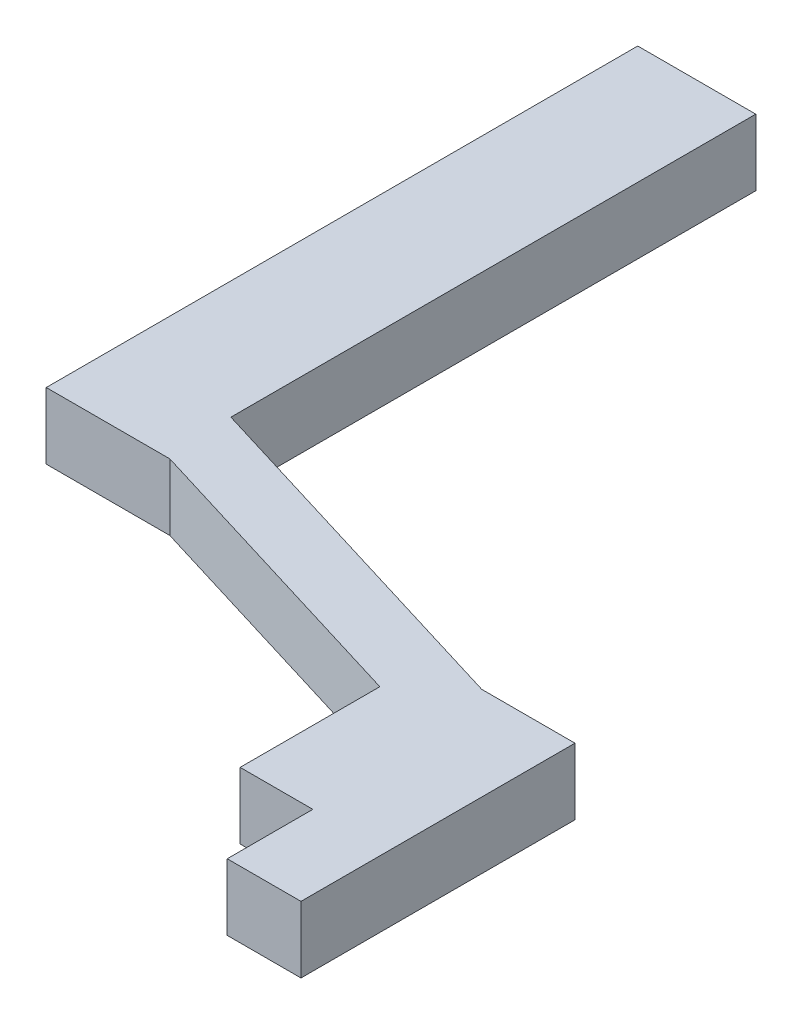
ISO-10303-21;
HEADER;
FILE_DESCRIPTION(('STEP AP214'),'2;1');
FILE_NAME('part.step','',(''),(''),'','','');
FILE_SCHEMA(('AUTOMOTIVE_DESIGN { 1 0 10303 214 1 1 1 1 }'));
ENDSEC;
DATA;
#1=APPLICATION_CONTEXT('core data for automotive mechanical design processes');
#2=APPLICATION_PROTOCOL_DEFINITION('international standard','automotive_design',2000,#1);
#3=PRODUCT_CONTEXT('',#1,'mechanical');
#4=PRODUCT('Part','Part','',(#3));
#5=PRODUCT_RELATED_PRODUCT_CATEGORY('part','',(#4));
#6=PRODUCT_DEFINITION_FORMATION('','',#4);
#7=PRODUCT_DEFINITION_CONTEXT('part definition',#1,'design');
#8=PRODUCT_DEFINITION('design','',#6,#7);
#9=PRODUCT_DEFINITION_SHAPE('','',#8);
#10=(LENGTH_UNIT() NAMED_UNIT(*) SI_UNIT(.MILLI.,.METRE.));
#11=(NAMED_UNIT(*) PLANE_ANGLE_UNIT() SI_UNIT($,.RADIAN.));
#12=(NAMED_UNIT(*) SI_UNIT($,.STERADIAN.) SOLID_ANGLE_UNIT());
#13=UNCERTAINTY_MEASURE_WITH_UNIT(LENGTH_MEASURE(1.E-05),#10,'distance_accuracy_value','');
#14=(GEOMETRIC_REPRESENTATION_CONTEXT(3) GLOBAL_UNCERTAINTY_ASSIGNED_CONTEXT((#13)) GLOBAL_UNIT_ASSIGNED_CONTEXT((#10,
#11,#12)) REPRESENTATION_CONTEXT('',''));
#15=CARTESIAN_POINT('',(0.,0.,0.));
#16=DIRECTION('',(0.,0.,1.));
#17=DIRECTION('',(1.,0.,0.));
#18=AXIS2_PLACEMENT_3D('',#15,#16,#17);
#19=CARTESIAN_POINT('',(1.196572983416,-0.225,0.260631497199));
#20=DIRECTION('',(0.,1.,0.));
#21=DIRECTION('',(0.,0.,-1.));
#22=AXIS2_PLACEMENT_3D('',#19,#20,#21);
#23=PLANE('',#22);
#24=DIRECTION('',(0.,0.,1.));
#25=VECTOR('',#24,1.);
#26=CARTESIAN_POINT('',(0.40000000004,-0.225,-3.1));
#27=LINE('',#26,#25);
#28=CARTESIAN_POINT('',(0.40000000004,-0.225,-3.1));
#29=VERTEX_POINT('',#28);
#30=CARTESIAN_POINT('',(0.40000000004,-0.225,0.457891584093));
#31=VERTEX_POINT('',#30);
#32=EDGE_CURVE('E11',#29,#31,#27,.T.);
#33=ORIENTED_EDGE('',*,*,#32,.T.);
#34=DIRECTION('',(0.956400292516615,0.,0.292059035939883));
#35=VECTOR('',#34,1.);
#36=CARTESIAN_POINT('',(0.40000000004,-0.225,0.457891584093));
#37=LINE('',#36,#35);
#38=CARTESIAN_POINT('',(2.84794798338,-0.225,1.205429339611));
#39=VERTEX_POINT('',#38);
#40=EDGE_CURVE('E209',#31,#39,#37,.T.);
#41=ORIENTED_EDGE('',*,*,#40,.T.);
#42=DIRECTION('',(1.,0.,0.));
#43=VECTOR('',#42,1.);
#44=CARTESIAN_POINT('',(2.84794798338,-0.225,1.205429339611));
#45=LINE('',#44,#43);
#46=CARTESIAN_POINT('',(3.48,-0.225,1.205429339611));
#47=VERTEX_POINT('',#46);
#48=EDGE_CURVE('E115',#39,#47,#45,.T.);
#49=ORIENTED_EDGE('',*,*,#48,.T.);
#50=DIRECTION('',(0.,0.,1.));
#51=VECTOR('',#50,1.);
#52=CARTESIAN_POINT('',(3.48,-0.225,1.205429339611));
#53=LINE('',#52,#51);
#54=CARTESIAN_POINT('',(3.48,-0.225,3.062715999999));
#55=VERTEX_POINT('',#54);
#56=EDGE_CURVE('E190',#47,#55,#53,.T.);
#57=ORIENTED_EDGE('',*,*,#56,.T.);
#58=DIRECTION('',(-1.,0.,0.));
#59=VECTOR('',#58,1.);
#60=CARTESIAN_POINT('',(3.48,-0.225,3.062715999999));
#61=LINE('',#60,#59);
#62=CARTESIAN_POINT('',(2.98,-0.225,3.062715999999));
#63=VERTEX_POINT('',#62);
#64=EDGE_CURVE('E197',#55,#63,#61,.T.);
#65=ORIENTED_EDGE('',*,*,#64,.T.);
#66=DIRECTION('',(0.,0.,-1.));
#67=VECTOR('',#66,1.);
#68=CARTESIAN_POINT('',(2.98,-0.225,3.062715999999));
#69=LINE('',#68,#67);
#70=CARTESIAN_POINT('',(2.98,-0.225,2.48242));
#71=VERTEX_POINT('',#70);
#72=EDGE_CURVE('E218',#63,#71,#69,.T.);
#73=ORIENTED_EDGE('',*,*,#72,.T.);
#74=DIRECTION('',(-1.,0.,0.));
#75=VECTOR('',#74,1.);
#76=CARTESIAN_POINT('',(2.98,-0.225,2.48242));
#77=LINE('',#76,#75);
#78=CARTESIAN_POINT('',(2.487124850331,-0.225,2.48242));
#79=VERTEX_POINT('',#78);
#80=EDGE_CURVE('E184',#71,#79,#77,.T.);
#81=ORIENTED_EDGE('',*,*,#80,.T.);
#82=DIRECTION('',(0.,0.,-1.));
#83=VECTOR('',#82,1.);
#84=CARTESIAN_POINT('',(2.487124850331,-0.225,2.48242));
#85=LINE('',#84,#83);
#86=CARTESIAN_POINT('',(2.487124850331,-0.225,1.535332874241));
#87=VERTEX_POINT('',#86);
#88=EDGE_CURVE('E204',#79,#87,#85,.T.);
#89=ORIENTED_EDGE('',*,*,#88,.T.);
#90=DIRECTION('',(-0.956400292518097,0.,-0.29205903593503));
#91=VECTOR('',#90,1.);
#92=CARTESIAN_POINT('',(2.487124850331,-0.225,1.535332874241));
#93=LINE('',#92,#91);
#94=CARTESIAN_POINT('',(0.437956929931,-0.225,0.90957187021));
#95=VERTEX_POINT('',#94);
#96=EDGE_CURVE('E222',#87,#95,#93,.T.);
#97=ORIENTED_EDGE('',*,*,#96,.T.);
#98=DIRECTION('',(-1.,0.,0.));
#99=VECTOR('',#98,1.);
#100=CARTESIAN_POINT('',(0.437956929931,-0.225,0.90957187021));
#101=LINE('',#100,#99);
#102=CARTESIAN_POINT('',(-0.4,-0.225,0.90957187021));
#103=VERTEX_POINT('',#102);
#104=EDGE_CURVE('E152',#95,#103,#101,.T.);
#105=ORIENTED_EDGE('',*,*,#104,.T.);
#106=DIRECTION('',(0.,0.,1.));
#107=VECTOR('',#106,1.);
#108=CARTESIAN_POINT('',(-0.4,-0.225,-3.1));
#109=LINE('',#108,#107);
#110=CARTESIAN_POINT('',(-0.4,-0.225,-3.1));
#111=VERTEX_POINT('',#110);
#112=EDGE_CURVE('E147',#111,#103,#109,.T.);
#113=ORIENTED_EDGE('',*,*,#112,.F.);
#114=DIRECTION('',(-1.,0.,0.));
#115=VECTOR('',#114,1.);
#116=CARTESIAN_POINT('',(0.40000000004,-0.225,-3.1));
#117=LINE('',#116,#115);
#118=EDGE_CURVE('E149',#29,#111,#117,.T.);
#119=ORIENTED_EDGE('',*,*,#118,.F.);
#120=EDGE_LOOP('',(#33,#41,#49,#57,#65,#73,#81,#89,#97,#105,#113,#119));
#121=FACE_BOUND('',#120,.T.);
#122=ADVANCED_FACE('F16',(#121),#23,.F.);
#123=CARTESIAN_POINT('',(1.196572983416,0.225,0.260631497199));
#124=DIRECTION('',(0.,1.,0.));
#125=DIRECTION('',(0.,0.,-1.));
#126=AXIS2_PLACEMENT_3D('',#123,#124,#125);
#127=PLANE('',#126);
#128=DIRECTION('',(-1.,0.,0.));
#129=VECTOR('',#128,1.);
#130=CARTESIAN_POINT('',(0.40000000004,0.225,-3.1));
#131=LINE('',#130,#129);
#132=CARTESIAN_POINT('',(0.40000000004,0.225,-3.1));
#133=VERTEX_POINT('',#132);
#134=CARTESIAN_POINT('',(-0.4,0.225,-3.1));
#135=VERTEX_POINT('',#134);
#136=EDGE_CURVE('E156',#133,#135,#131,.T.);
#137=ORIENTED_EDGE('',*,*,#136,.T.);
#138=DIRECTION('',(0.,0.,1.));
#139=VECTOR('',#138,1.);
#140=CARTESIAN_POINT('',(-0.4,0.225,-3.1));
#141=LINE('',#140,#139);
#142=CARTESIAN_POINT('',(-0.4,0.225,0.90957187021));
#143=VERTEX_POINT('',#142);
#144=EDGE_CURVE('E141',#135,#143,#141,.T.);
#145=ORIENTED_EDGE('',*,*,#144,.T.);
#146=DIRECTION('',(-1.,0.,0.));
#147=VECTOR('',#146,1.);
#148=CARTESIAN_POINT('',(0.437956929931,0.225,0.90957187021));
#149=LINE('',#148,#147);
#150=CARTESIAN_POINT('',(0.437956929931,0.225,0.90957187021));
#151=VERTEX_POINT('',#150);
#152=EDGE_CURVE('E187',#151,#143,#149,.T.);
#153=ORIENTED_EDGE('',*,*,#152,.F.);
#154=DIRECTION('',(-0.956400292518097,0.,-0.29205903593503));
#155=VECTOR('',#154,1.);
#156=CARTESIAN_POINT('',(2.487124850331,0.225,1.535332874241));
#157=LINE('',#156,#155);
#158=CARTESIAN_POINT('',(2.487124850331,0.225,1.535332874241));
#159=VERTEX_POINT('',#158);
#160=EDGE_CURVE('E226',#159,#151,#157,.T.);
#161=ORIENTED_EDGE('',*,*,#160,.F.);
#162=DIRECTION('',(0.,0.,-1.));
#163=VECTOR('',#162,1.);
#164=CARTESIAN_POINT('',(2.487124850331,0.225,2.48242));
#165=LINE('',#164,#163);
#166=CARTESIAN_POINT('',(2.487124850331,0.225,2.48242));
#167=VERTEX_POINT('',#166);
#168=EDGE_CURVE('E228',#167,#159,#165,.T.);
#169=ORIENTED_EDGE('',*,*,#168,.F.);
#170=DIRECTION('',(-1.,0.,0.));
#171=VECTOR('',#170,1.);
#172=CARTESIAN_POINT('',(2.98,0.225,2.48242));
#173=LINE('',#172,#171);
#174=CARTESIAN_POINT('',(2.98,0.225,2.48242));
#175=VERTEX_POINT('',#174);
#176=EDGE_CURVE('E196',#175,#167,#173,.T.);
#177=ORIENTED_EDGE('',*,*,#176,.F.);
#178=DIRECTION('',(0.,0.,-1.));
#179=VECTOR('',#178,1.);
#180=CARTESIAN_POINT('',(2.98,0.225,3.062715999999));
#181=LINE('',#180,#179);
#182=CARTESIAN_POINT('',(2.98,0.225,3.062715999999));
#183=VERTEX_POINT('',#182);
#184=EDGE_CURVE('E183',#183,#175,#181,.T.);
#185=ORIENTED_EDGE('',*,*,#184,.F.);
#186=DIRECTION('',(-1.,0.,0.));
#187=VECTOR('',#186,1.);
#188=CARTESIAN_POINT('',(3.48,0.225,3.062715999999));
#189=LINE('',#188,#187);
#190=CARTESIAN_POINT('',(3.48,0.225,3.062715999999));
#191=VERTEX_POINT('',#190);
#192=EDGE_CURVE('E20',#191,#183,#189,.T.);
#193=ORIENTED_EDGE('',*,*,#192,.F.);
#194=DIRECTION('',(0.,0.,1.));
#195=VECTOR('',#194,1.);
#196=CARTESIAN_POINT('',(3.48,0.225,1.205429339611));
#197=LINE('',#196,#195);
#198=CARTESIAN_POINT('',(3.48,0.225,1.205429339611));
#199=VERTEX_POINT('',#198);
#200=EDGE_CURVE('E188',#199,#191,#197,.T.);
#201=ORIENTED_EDGE('',*,*,#200,.F.);
#202=DIRECTION('',(1.,0.,0.));
#203=VECTOR('',#202,1.);
#204=CARTESIAN_POINT('',(2.84794798338,0.225,1.205429339611));
#205=LINE('',#204,#203);
#206=CARTESIAN_POINT('',(2.84794798338,0.225,1.205429339611));
#207=VERTEX_POINT('',#206);
#208=EDGE_CURVE('E205',#207,#199,#205,.T.);
#209=ORIENTED_EDGE('',*,*,#208,.F.);
#210=DIRECTION('',(0.956400292516615,0.,0.292059035939883));
#211=VECTOR('',#210,1.);
#212=CARTESIAN_POINT('',(0.40000000004,0.225,0.457891584093));
#213=LINE('',#212,#211);
#214=CARTESIAN_POINT('',(0.40000000004,0.225,0.457891584093));
#215=VERTEX_POINT('',#214);
#216=EDGE_CURVE('E125',#215,#207,#213,.T.);
#217=ORIENTED_EDGE('',*,*,#216,.F.);
#218=DIRECTION('',(0.,0.,1.));
#219=VECTOR('',#218,1.);
#220=CARTESIAN_POINT('',(0.40000000004,0.225,-3.1));
#221=LINE('',#220,#219);
#222=EDGE_CURVE('E27',#133,#215,#221,.T.);
#223=ORIENTED_EDGE('',*,*,#222,.F.);
#224=EDGE_LOOP('',(#137,#145,#153,#161,#169,#177,#185,#193,#201,#209,#217,#223));
#225=FACE_BOUND('',#224,.T.);
#226=ADVANCED_FACE('F284',(#225),#127,.T.);
#227=CARTESIAN_POINT('',(0.40000000004,0.225,-3.1));
#228=DIRECTION('',(-1.,0.,0.));
#229=DIRECTION('',(0.,0.,1.));
#230=AXIS2_PLACEMENT_3D('',#227,#228,#229);
#231=PLANE('',#230);
#232=ORIENTED_EDGE('',*,*,#222,.T.);
#233=DIRECTION('',(0.,-1.,0.));
#234=VECTOR('',#233,1.);
#235=CARTESIAN_POINT('',(0.40000000004,0.225,0.457891584093));
#236=LINE('',#235,#234);
#237=EDGE_CURVE('E212',#215,#31,#236,.T.);
#238=ORIENTED_EDGE('',*,*,#237,.T.);
#239=ORIENTED_EDGE('',*,*,#32,.F.);
#240=DIRECTION('',(0.,-1.,0.));
#241=VECTOR('',#240,1.);
#242=CARTESIAN_POINT('',(0.40000000004,0.225,-3.1));
#243=LINE('',#242,#241);
#244=EDGE_CURVE('E167',#133,#29,#243,.T.);
#245=ORIENTED_EDGE('',*,*,#244,.F.);
#246=EDGE_LOOP('',(#232,#238,#239,#245));
#247=FACE_BOUND('',#246,.T.);
#248=ADVANCED_FACE('F238',(#247),#231,.F.);
#249=CARTESIAN_POINT('',(0.40000000004,0.225,0.457891584093));
#250=DIRECTION('',(-0.292059035939883,0.,0.956400292516615));
#251=DIRECTION('',(0.,1.,0.));
#252=AXIS2_PLACEMENT_3D('',#249,#250,#251);
#253=PLANE('',#252);
#254=ORIENTED_EDGE('',*,*,#216,.T.);
#255=DIRECTION('',(0.,-1.,0.));
#256=VECTOR('',#255,1.);
#257=CARTESIAN_POINT('',(2.84794798338,0.225,1.205429339611));
#258=LINE('',#257,#256);
#259=EDGE_CURVE('E217',#207,#39,#258,.T.);
#260=ORIENTED_EDGE('',*,*,#259,.T.);
#261=ORIENTED_EDGE('',*,*,#40,.F.);
#262=ORIENTED_EDGE('',*,*,#237,.F.);
#263=EDGE_LOOP('',(#254,#260,#261,#262));
#264=FACE_BOUND('',#263,.T.);
#265=ADVANCED_FACE('F18',(#264),#253,.F.);
#266=CARTESIAN_POINT('',(2.84794798338,0.225,1.205429339611));
#267=DIRECTION('',(0.,0.,1.));
#268=DIRECTION('',(0.,-1.,0.));
#269=AXIS2_PLACEMENT_3D('',#266,#267,#268);
#270=PLANE('',#269);
#271=ORIENTED_EDGE('',*,*,#208,.T.);
#272=DIRECTION('',(0.,-1.,0.));
#273=VECTOR('',#272,1.);
#274=CARTESIAN_POINT('',(3.48,0.225,1.205429339611));
#275=LINE('',#274,#273);
#276=EDGE_CURVE('E208',#199,#47,#275,.T.);
#277=ORIENTED_EDGE('',*,*,#276,.T.);
#278=ORIENTED_EDGE('',*,*,#48,.F.);
#279=ORIENTED_EDGE('',*,*,#259,.F.);
#280=EDGE_LOOP('',(#271,#277,#278,#279));
#281=FACE_BOUND('',#280,.T.);
#282=ADVANCED_FACE('F243',(#281),#270,.F.);
#283=CARTESIAN_POINT('',(3.48,0.225,1.205429339611));
#284=DIRECTION('',(-1.,0.,0.));
#285=DIRECTION('',(0.,0.,1.));
#286=AXIS2_PLACEMENT_3D('',#283,#284,#285);
#287=PLANE('',#286);
#288=ORIENTED_EDGE('',*,*,#200,.T.);
#289=DIRECTION('',(0.,-1.,0.));
#290=VECTOR('',#289,1.);
#291=CARTESIAN_POINT('',(3.48,0.225,3.062715999999));
#292=LINE('',#291,#290);
#293=EDGE_CURVE('E177',#191,#55,#292,.T.);
#294=ORIENTED_EDGE('',*,*,#293,.T.);
#295=ORIENTED_EDGE('',*,*,#56,.F.);
#296=ORIENTED_EDGE('',*,*,#276,.F.);
#297=EDGE_LOOP('',(#288,#294,#295,#296));
#298=FACE_BOUND('',#297,.T.);
#299=ADVANCED_FACE('F251',(#298),#287,.F.);
#300=CARTESIAN_POINT('',(3.48,0.225,3.062715999999));
#301=DIRECTION('',(0.,0.,-1.));
#302=DIRECTION('',(-1.,0.,0.));
#303=AXIS2_PLACEMENT_3D('',#300,#301,#302);
#304=PLANE('',#303);
#305=ORIENTED_EDGE('',*,*,#192,.T.);
#306=DIRECTION('',(0.,-1.,0.));
#307=VECTOR('',#306,1.);
#308=CARTESIAN_POINT('',(2.98,0.225,3.062715999999));
#309=LINE('',#308,#307);
#310=EDGE_CURVE('E221',#183,#63,#309,.T.);
#311=ORIENTED_EDGE('',*,*,#310,.T.);
#312=ORIENTED_EDGE('',*,*,#64,.F.);
#313=ORIENTED_EDGE('',*,*,#293,.F.);
#314=EDGE_LOOP('',(#305,#311,#312,#313));
#315=FACE_BOUND('',#314,.T.);
#316=ADVANCED_FACE('F297',(#315),#304,.F.);
#317=CARTESIAN_POINT('',(2.98,0.225,3.062715999999));
#318=DIRECTION('',(1.,0.,0.));
#319=DIRECTION('',(0.,1.,0.));
#320=AXIS2_PLACEMENT_3D('',#317,#318,#319);
#321=PLANE('',#320);
#322=ORIENTED_EDGE('',*,*,#184,.T.);
#323=DIRECTION('',(0.,-1.,0.));
#324=VECTOR('',#323,1.);
#325=CARTESIAN_POINT('',(2.98,0.225,2.48242));
#326=LINE('',#325,#324);
#327=EDGE_CURVE('E179',#175,#71,#326,.T.);
#328=ORIENTED_EDGE('',*,*,#327,.T.);
#329=ORIENTED_EDGE('',*,*,#72,.F.);
#330=ORIENTED_EDGE('',*,*,#310,.F.);
#331=EDGE_LOOP('',(#322,#328,#329,#330));
#332=FACE_BOUND('',#331,.T.);
#333=ADVANCED_FACE('F273',(#332),#321,.F.);
#334=CARTESIAN_POINT('',(2.98,0.225,2.48242));
#335=DIRECTION('',(0.,0.,-1.));
#336=DIRECTION('',(-1.,0.,0.));
#337=AXIS2_PLACEMENT_3D('',#334,#335,#336);
#338=PLANE('',#337);
#339=ORIENTED_EDGE('',*,*,#176,.T.);
#340=DIRECTION('',(0.,-1.,0.));
#341=VECTOR('',#340,1.);
#342=CARTESIAN_POINT('',(2.487124850331,0.225,2.48242));
#343=LINE('',#342,#341);
#344=EDGE_CURVE('E200',#167,#79,#343,.T.);
#345=ORIENTED_EDGE('',*,*,#344,.T.);
#346=ORIENTED_EDGE('',*,*,#80,.F.);
#347=ORIENTED_EDGE('',*,*,#327,.F.);
#348=EDGE_LOOP('',(#339,#345,#346,#347));
#349=FACE_BOUND('',#348,.T.);
#350=ADVANCED_FACE('F281',(#349),#338,.F.);
#351=CARTESIAN_POINT('',(2.487124850331,0.225,2.48242));
#352=DIRECTION('',(1.,0.,0.));
#353=DIRECTION('',(0.,1.,0.));
#354=AXIS2_PLACEMENT_3D('',#351,#352,#353);
#355=PLANE('',#354);
#356=ORIENTED_EDGE('',*,*,#168,.T.);
#357=DIRECTION('',(0.,-1.,0.));
#358=VECTOR('',#357,1.);
#359=CARTESIAN_POINT('',(2.487124850331,0.225,1.535332874241));
#360=LINE('',#359,#358);
#361=EDGE_CURVE('E225',#159,#87,#360,.T.);
#362=ORIENTED_EDGE('',*,*,#361,.T.);
#363=ORIENTED_EDGE('',*,*,#88,.F.);
#364=ORIENTED_EDGE('',*,*,#344,.F.);
#365=EDGE_LOOP('',(#356,#362,#363,#364));
#366=FACE_BOUND('',#365,.T.);
#367=ADVANCED_FACE('F289',(#366),#355,.F.);
#368=CARTESIAN_POINT('',(2.487124850331,0.225,1.535332874241));
#369=DIRECTION('',(0.29205903593503,0.,-0.956400292518097));
#370=DIRECTION('',(0.,-1.,0.));
#371=AXIS2_PLACEMENT_3D('',#368,#369,#370);
#372=PLANE('',#371);
#373=ORIENTED_EDGE('',*,*,#160,.T.);
#374=DIRECTION('',(0.,-1.,0.));
#375=VECTOR('',#374,1.);
#376=CARTESIAN_POINT('',(0.437956929931,0.225,0.90957187021));
#377=LINE('',#376,#375);
#378=EDGE_CURVE('E263',#151,#95,#377,.T.);
#379=ORIENTED_EDGE('',*,*,#378,.T.);
#380=ORIENTED_EDGE('',*,*,#96,.F.);
#381=ORIENTED_EDGE('',*,*,#361,.F.);
#382=EDGE_LOOP('',(#373,#379,#380,#381));
#383=FACE_BOUND('',#382,.T.);
#384=ADVANCED_FACE('F293',(#383),#372,.F.);
#385=CARTESIAN_POINT('',(0.437956929931,0.225,0.90957187021));
#386=DIRECTION('',(0.,0.,-1.));
#387=DIRECTION('',(-1.,0.,0.));
#388=AXIS2_PLACEMENT_3D('',#385,#386,#387);
#389=PLANE('',#388);
#390=ORIENTED_EDGE('',*,*,#152,.T.);
#391=DIRECTION('',(0.,-1.,0.));
#392=VECTOR('',#391,1.);
#393=CARTESIAN_POINT('',(-0.4,0.225,0.90957187021));
#394=LINE('',#393,#392);
#395=EDGE_CURVE('E155',#143,#103,#394,.T.);
#396=ORIENTED_EDGE('',*,*,#395,.T.);
#397=ORIENTED_EDGE('',*,*,#104,.F.);
#398=ORIENTED_EDGE('',*,*,#378,.F.);
#399=EDGE_LOOP('',(#390,#396,#397,#398));
#400=FACE_BOUND('',#399,.T.);
#401=ADVANCED_FACE('F421',(#400),#389,.F.);
#402=CARTESIAN_POINT('',(-0.4,0.225,-3.1));
#403=DIRECTION('',(-1.,0.,0.));
#404=DIRECTION('',(0.,0.,1.));
#405=AXIS2_PLACEMENT_3D('',#402,#403,#404);
#406=PLANE('',#405);
#407=DIRECTION('',(0.,-1.,0.));
#408=VECTOR('',#407,1.);
#409=CARTESIAN_POINT('',(-0.4,0.225,-3.1));
#410=LINE('',#409,#408);
#411=EDGE_CURVE('E159',#135,#111,#410,.T.);
#412=ORIENTED_EDGE('',*,*,#411,.T.);
#413=ORIENTED_EDGE('',*,*,#112,.T.);
#414=ORIENTED_EDGE('',*,*,#395,.F.);
#415=ORIENTED_EDGE('',*,*,#144,.F.);
#416=EDGE_LOOP('',(#412,#413,#414,#415));
#417=FACE_BOUND('',#416,.T.);
#418=ADVANCED_FACE('F160',(#417),#406,.T.);
#419=CARTESIAN_POINT('',(0.40000000004,0.225,-3.1));
#420=DIRECTION('',(0.,0.,-1.));
#421=DIRECTION('',(-1.,0.,0.));
#422=AXIS2_PLACEMENT_3D('',#419,#420,#421);
#423=PLANE('',#422);
#424=ORIENTED_EDGE('',*,*,#244,.T.);
#425=ORIENTED_EDGE('',*,*,#118,.T.);
#426=ORIENTED_EDGE('',*,*,#411,.F.);
#427=ORIENTED_EDGE('',*,*,#136,.F.);
#428=EDGE_LOOP('',(#424,#425,#426,#427));
#429=FACE_BOUND('',#428,.T.);
#430=ADVANCED_FACE('F165',(#429),#423,.T.);
#431=CLOSED_SHELL('',(#122,#226,#248,#265,#282,#299,#316,#333,#350,#367,#384,#401,#418,#430));
#432=MANIFOLD_SOLID_BREP('B1',#431);
#433=ADVANCED_BREP_SHAPE_REPRESENTATION('',(#18,#432),#14);
#434=SHAPE_DEFINITION_REPRESENTATION(#9,#433);
ENDSEC;
END-ISO-10303-21;
